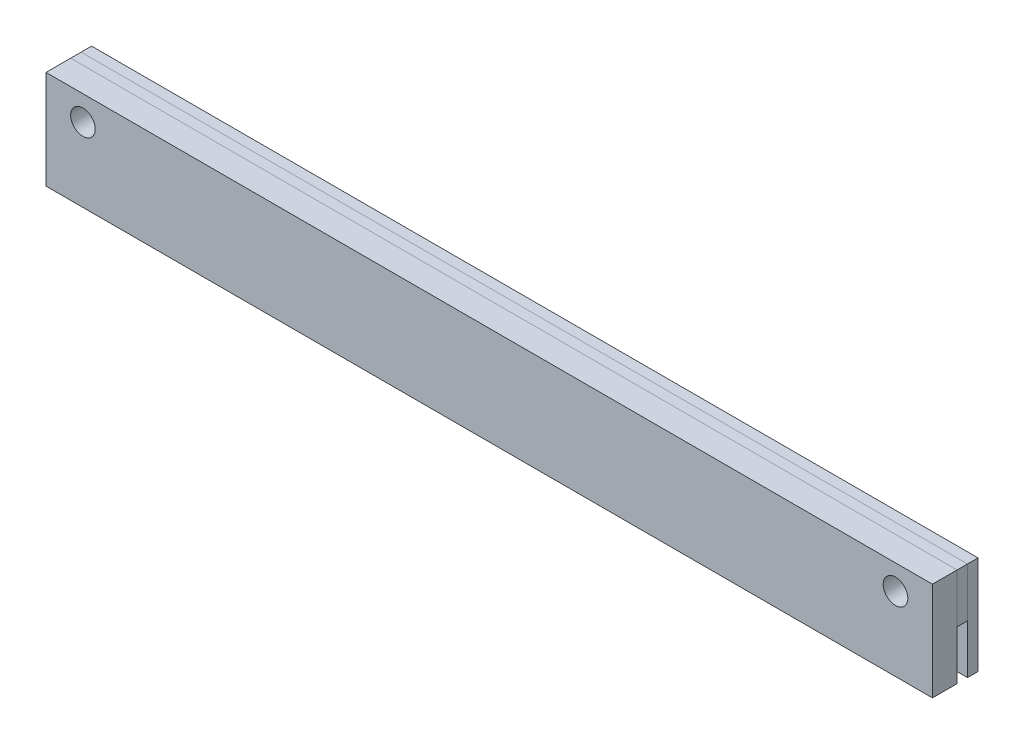
ISO-10303-21;
HEADER;
FILE_DESCRIPTION(('STEP AP214'),'2;1');
FILE_NAME('part.step','',(''),(''),'','','');
FILE_SCHEMA(('AUTOMOTIVE_DESIGN { 1 0 10303 214 1 1 1 1 }'));
ENDSEC;
DATA;
#1=APPLICATION_CONTEXT('core data for automotive mechanical design processes');
#2=APPLICATION_PROTOCOL_DEFINITION('international standard','automotive_design',2000,#1);
#3=PRODUCT_CONTEXT('',#1,'mechanical');
#4=PRODUCT('Part','Part','',(#3));
#5=PRODUCT_RELATED_PRODUCT_CATEGORY('part','',(#4));
#6=PRODUCT_DEFINITION_FORMATION('','',#4);
#7=PRODUCT_DEFINITION_CONTEXT('part definition',#1,'design');
#8=PRODUCT_DEFINITION('design','',#6,#7);
#9=PRODUCT_DEFINITION_SHAPE('','',#8);
#10=(LENGTH_UNIT() NAMED_UNIT(*) SI_UNIT(.MILLI.,.METRE.));
#11=(NAMED_UNIT(*) PLANE_ANGLE_UNIT() SI_UNIT($,.RADIAN.));
#12=(NAMED_UNIT(*) SI_UNIT($,.STERADIAN.) SOLID_ANGLE_UNIT());
#13=UNCERTAINTY_MEASURE_WITH_UNIT(LENGTH_MEASURE(1.E-05),#10,'distance_accuracy_value','');
#14=(GEOMETRIC_REPRESENTATION_CONTEXT(3) GLOBAL_UNCERTAINTY_ASSIGNED_CONTEXT((#13)) GLOBAL_UNIT_ASSIGNED_CONTEXT((#10,
#11,#12)) REPRESENTATION_CONTEXT('',''));
#15=CARTESIAN_POINT('',(0.,0.,0.));
#16=DIRECTION('',(0.,0.,1.));
#17=DIRECTION('',(1.,0.,0.));
#18=AXIS2_PLACEMENT_3D('',#15,#16,#17);
#19=CARTESIAN_POINT('',(114.3,0.,-4.05));
#20=DIRECTION('',(0.,0.,-1.));
#21=DIRECTION('',(0.,1.,0.));
#22=AXIS2_PLACEMENT_3D('',#19,#20,#21);
#23=PLANE('',#22);
#24=CARTESIAN_POINT('',(-104.775,0.,-4.05));
#25=DIRECTION('',(0.,0.,-1.));
#26=DIRECTION('',(0.,1.,0.));
#27=AXIS2_PLACEMENT_3D('',#24,#25,#26);
#28=CIRCLE('',#27,3.175);
#29=CARTESIAN_POINT('',(-104.775,3.17500000000002,-4.05));
#30=VERTEX_POINT('',#29);
#31=EDGE_CURVE('E124',#30,#30,#28,.F.);
#32=ORIENTED_EDGE('',*,*,#31,.T.);
#33=EDGE_LOOP('',(#32));
#34=FACE_BOUND('',#33,.T.);
#35=CARTESIAN_POINT('',(104.775,0.,-4.05));
#36=DIRECTION('',(0.,0.,-1.));
#37=DIRECTION('',(0.,1.,0.));
#38=AXIS2_PLACEMENT_3D('',#35,#36,#37);
#39=CIRCLE('',#38,3.175);
#40=CARTESIAN_POINT('',(104.775,3.17500000000002,-4.05));
#41=VERTEX_POINT('',#40);
#42=EDGE_CURVE('E129',#41,#41,#39,.F.);
#43=ORIENTED_EDGE('',*,*,#42,.T.);
#44=EDGE_LOOP('',(#43));
#45=FACE_BOUND('',#44,.T.);
#46=DIRECTION('',(0.,-1.,0.));
#47=VECTOR('',#46,1.);
#48=CARTESIAN_POINT('',(-114.3,0.,-4.05));
#49=LINE('',#48,#47);
#50=CARTESIAN_POINT('',(-114.3,6.35,-4.05));
#51=VERTEX_POINT('',#50);
#52=CARTESIAN_POINT('',(-114.3,-19.05,-4.05));
#53=VERTEX_POINT('',#52);
#54=EDGE_CURVE('E115',#51,#53,#49,.T.);
#55=ORIENTED_EDGE('',*,*,#54,.F.);
#56=DIRECTION('',(-1.,0.,0.));
#57=VECTOR('',#56,1.);
#58=CARTESIAN_POINT('',(114.3,6.35,-4.05));
#59=LINE('',#58,#57);
#60=CARTESIAN_POINT('',(114.3,6.35,-4.05));
#61=VERTEX_POINT('',#60);
#62=EDGE_CURVE('E12',#61,#51,#59,.T.);
#63=ORIENTED_EDGE('',*,*,#62,.F.);
#64=DIRECTION('',(0.,-1.,0.));
#65=VECTOR('',#64,1.);
#66=CARTESIAN_POINT('',(114.3,0.,-4.05));
#67=LINE('',#66,#65);
#68=CARTESIAN_POINT('',(114.3,-19.05,-4.05));
#69=VERTEX_POINT('',#68);
#70=EDGE_CURVE('E108',#61,#69,#67,.T.);
#71=ORIENTED_EDGE('',*,*,#70,.T.);
#72=DIRECTION('',(-1.,0.,0.));
#73=VECTOR('',#72,1.);
#74=CARTESIAN_POINT('',(114.3,-19.05,-4.05));
#75=LINE('',#74,#73);
#76=EDGE_CURVE('E88',#69,#53,#75,.T.);
#77=ORIENTED_EDGE('',*,*,#76,.T.);
#78=EDGE_LOOP('',(#55,#63,#71,#77));
#79=FACE_BOUND('',#78,.T.);
#80=ADVANCED_FACE('F48',(#34,#45,#79),#23,.T.);
#81=CARTESIAN_POINT('',(114.3,6.35,0.));
#82=DIRECTION('',(0.,1.,0.));
#83=DIRECTION('',(0.,0.,1.));
#84=AXIS2_PLACEMENT_3D('',#81,#82,#83);
#85=PLANE('',#84);
#86=DIRECTION('',(0.,0.,-1.));
#87=VECTOR('',#86,1.);
#88=CARTESIAN_POINT('',(-114.3,6.35,0.));
#89=LINE('',#88,#87);
#90=CARTESIAN_POINT('',(-114.3,6.35,-1.35));
#91=VERTEX_POINT('',#90);
#92=EDGE_CURVE('E101',#91,#51,#89,.T.);
#93=ORIENTED_EDGE('',*,*,#92,.F.);
#94=DIRECTION('',(-1.,0.,0.));
#95=VECTOR('',#94,1.);
#96=CARTESIAN_POINT('',(114.3,6.35,-1.35));
#97=LINE('',#96,#95);
#98=CARTESIAN_POINT('',(114.3,6.35,-1.35));
#99=VERTEX_POINT('',#98);
#100=EDGE_CURVE('E57',#99,#91,#97,.T.);
#101=ORIENTED_EDGE('',*,*,#100,.F.);
#102=DIRECTION('',(0.,0.,-1.));
#103=VECTOR('',#102,1.);
#104=CARTESIAN_POINT('',(114.3,6.35,0.));
#105=LINE('',#104,#103);
#106=EDGE_CURVE('E99',#99,#61,#105,.T.);
#107=ORIENTED_EDGE('',*,*,#106,.T.);
#108=ORIENTED_EDGE('',*,*,#62,.T.);
#109=EDGE_LOOP('',(#93,#101,#107,#108));
#110=FACE_BOUND('',#109,.T.);
#111=ADVANCED_FACE('F97',(#110),#85,.T.);
#112=CARTESIAN_POINT('',(114.3,0.,-1.35));
#113=DIRECTION('',(0.,0.,-1.));
#114=DIRECTION('',(0.,1.,0.));
#115=AXIS2_PLACEMENT_3D('',#112,#113,#114);
#116=PLANE('',#115);
#117=CARTESIAN_POINT('',(-104.775,0.,-1.35));
#118=DIRECTION('',(0.,0.,-1.));
#119=DIRECTION('',(0.,1.,0.));
#120=AXIS2_PLACEMENT_3D('',#117,#118,#119);
#121=CIRCLE('',#120,3.175);
#122=CARTESIAN_POINT('',(-104.775,3.17500000000002,-1.35));
#123=VERTEX_POINT('',#122);
#124=EDGE_CURVE('E51',#123,#123,#121,.T.);
#125=ORIENTED_EDGE('',*,*,#124,.T.);
#126=EDGE_LOOP('',(#125));
#127=FACE_BOUND('',#126,.T.);
#128=CARTESIAN_POINT('',(104.775,0.,-1.35));
#129=DIRECTION('',(0.,0.,-1.));
#130=DIRECTION('',(0.,1.,0.));
#131=AXIS2_PLACEMENT_3D('',#128,#129,#130);
#132=CIRCLE('',#131,3.175);
#133=CARTESIAN_POINT('',(104.775,3.17500000000002,-1.35));
#134=VERTEX_POINT('',#133);
#135=EDGE_CURVE('E122',#134,#134,#132,.T.);
#136=ORIENTED_EDGE('',*,*,#135,.T.);
#137=EDGE_LOOP('',(#136));
#138=FACE_BOUND('',#137,.T.);
#139=DIRECTION('',(0.,-1.,0.));
#140=VECTOR('',#139,1.);
#141=CARTESIAN_POINT('',(-114.3,0.,-1.35));
#142=LINE('',#141,#140);
#143=CARTESIAN_POINT('',(-114.3,-19.05,-1.35));
#144=VERTEX_POINT('',#143);
#145=EDGE_CURVE('E81',#91,#144,#142,.T.);
#146=ORIENTED_EDGE('',*,*,#145,.T.);
#147=DIRECTION('',(-1.,0.,0.));
#148=VECTOR('',#147,1.);
#149=CARTESIAN_POINT('',(114.3,-19.05,-1.35));
#150=LINE('',#149,#148);
#151=CARTESIAN_POINT('',(114.3,-19.05,-1.35));
#152=VERTEX_POINT('',#151);
#153=EDGE_CURVE('E102',#152,#144,#150,.T.);
#154=ORIENTED_EDGE('',*,*,#153,.F.);
#155=DIRECTION('',(0.,-1.,0.));
#156=VECTOR('',#155,1.);
#157=CARTESIAN_POINT('',(114.3,0.,-1.35));
#158=LINE('',#157,#156);
#159=EDGE_CURVE('E104',#99,#152,#158,.T.);
#160=ORIENTED_EDGE('',*,*,#159,.F.);
#161=ORIENTED_EDGE('',*,*,#100,.T.);
#162=EDGE_LOOP('',(#146,#154,#160,#161));
#163=FACE_BOUND('',#162,.T.);
#164=ADVANCED_FACE('F105',(#127,#138,#163),#116,.F.);
#165=CARTESIAN_POINT('',(114.3,-19.05,0.));
#166=DIRECTION('',(0.,1.,0.));
#167=DIRECTION('',(0.,0.,1.));
#168=AXIS2_PLACEMENT_3D('',#165,#166,#167);
#169=PLANE('',#168);
#170=DIRECTION('',(0.,0.,-1.));
#171=VECTOR('',#170,1.);
#172=CARTESIAN_POINT('',(-114.3,-19.05,0.));
#173=LINE('',#172,#171);
#174=EDGE_CURVE('E110',#144,#53,#173,.T.);
#175=ORIENTED_EDGE('',*,*,#174,.T.);
#176=ORIENTED_EDGE('',*,*,#76,.F.);
#177=DIRECTION('',(0.,0.,-1.));
#178=VECTOR('',#177,1.);
#179=CARTESIAN_POINT('',(114.3,-19.05,0.));
#180=LINE('',#179,#178);
#181=EDGE_CURVE('E66',#152,#69,#180,.T.);
#182=ORIENTED_EDGE('',*,*,#181,.F.);
#183=ORIENTED_EDGE('',*,*,#153,.T.);
#184=EDGE_LOOP('',(#175,#176,#182,#183));
#185=FACE_BOUND('',#184,.T.);
#186=ADVANCED_FACE('F159',(#185),#169,.F.);
#187=CARTESIAN_POINT('',(114.3,0.,0.));
#188=DIRECTION('',(1.,0.,0.));
#189=DIRECTION('',(0.,0.,-1.));
#190=AXIS2_PLACEMENT_3D('',#187,#188,#189);
#191=PLANE('',#190);
#192=ORIENTED_EDGE('',*,*,#70,.F.);
#193=ORIENTED_EDGE('',*,*,#106,.F.);
#194=ORIENTED_EDGE('',*,*,#159,.T.);
#195=ORIENTED_EDGE('',*,*,#181,.T.);
#196=EDGE_LOOP('',(#192,#193,#194,#195));
#197=FACE_BOUND('',#196,.T.);
#198=ADVANCED_FACE('F107',(#197),#191,.T.);
#199=CARTESIAN_POINT('',(-114.3,0.,0.));
#200=DIRECTION('',(1.,0.,0.));
#201=DIRECTION('',(0.,0.,-1.));
#202=AXIS2_PLACEMENT_3D('',#199,#200,#201);
#203=PLANE('',#202);
#204=ORIENTED_EDGE('',*,*,#54,.T.);
#205=ORIENTED_EDGE('',*,*,#174,.F.);
#206=ORIENTED_EDGE('',*,*,#145,.F.);
#207=ORIENTED_EDGE('',*,*,#92,.T.);
#208=EDGE_LOOP('',(#204,#205,#206,#207));
#209=FACE_BOUND('',#208,.T.);
#210=ADVANCED_FACE('F141',(#209),#203,.F.);
#211=CARTESIAN_POINT('',(104.775,0.,-13.0302561210691));
#212=DIRECTION('',(0.,0.,1.));
#213=DIRECTION('',(1.,0.,0.));
#214=AXIS2_PLACEMENT_3D('',#211,#212,#213);
#215=CYLINDRICAL_SURFACE('',#214,3.175);
#216=ORIENTED_EDGE('',*,*,#42,.F.);
#217=EDGE_LOOP('',(#216));
#218=FACE_BOUND('',#217,.T.);
#219=ORIENTED_EDGE('',*,*,#135,.F.);
#220=EDGE_LOOP('',(#219));
#221=FACE_BOUND('',#220,.T.);
#222=ADVANCED_FACE('F137',(#218,#221),#215,.F.);
#223=CARTESIAN_POINT('',(-104.775,0.,-13.0302561210691));
#224=DIRECTION('',(0.,0.,1.));
#225=DIRECTION('',(1.,0.,0.));
#226=AXIS2_PLACEMENT_3D('',#223,#224,#225);
#227=CYLINDRICAL_SURFACE('',#226,3.175);
#228=ORIENTED_EDGE('',*,*,#31,.F.);
#229=EDGE_LOOP('',(#228));
#230=FACE_BOUND('',#229,.T.);
#231=ORIENTED_EDGE('',*,*,#124,.F.);
#232=EDGE_LOOP('',(#231));
#233=FACE_BOUND('',#232,.T.);
#234=ADVANCED_FACE('F140',(#230,#233),#227,.F.);
#235=CLOSED_SHELL('',(#80,#111,#164,#186,#198,#210,#222,#234));
#236=MANIFOLD_SOLID_BREP('B2',#235);
#237=CARTESIAN_POINT('',(114.3,0.,-1.35));
#238=DIRECTION('',(0.,0.,-1.));
#239=DIRECTION('',(0.,1.,0.));
#240=AXIS2_PLACEMENT_3D('',#237,#238,#239);
#241=PLANE('',#240);
#242=CARTESIAN_POINT('',(-104.775,0.,-1.35));
#243=DIRECTION('',(0.,0.,-1.));
#244=DIRECTION('',(0.,1.,0.));
#245=AXIS2_PLACEMENT_3D('',#242,#243,#244);
#246=CIRCLE('',#245,3.175);
#247=CARTESIAN_POINT('',(-104.775,3.17500000000002,-1.35));
#248=VERTEX_POINT('',#247);
#249=EDGE_CURVE('E296',#248,#248,#246,.T.);
#250=ORIENTED_EDGE('',*,*,#249,.F.);
#251=EDGE_LOOP('',(#250));
#252=FACE_BOUND('',#251,.T.);
#253=CARTESIAN_POINT('',(104.775,0.,-1.35));
#254=DIRECTION('',(0.,0.,-1.));
#255=DIRECTION('',(0.,1.,0.));
#256=AXIS2_PLACEMENT_3D('',#253,#254,#255);
#257=CIRCLE('',#256,3.175);
#258=CARTESIAN_POINT('',(104.775,3.17500000000002,-1.35));
#259=VERTEX_POINT('',#258);
#260=EDGE_CURVE('E303',#259,#259,#257,.T.);
#261=ORIENTED_EDGE('',*,*,#260,.F.);
#262=EDGE_LOOP('',(#261));
#263=FACE_BOUND('',#262,.T.);
#264=DIRECTION('',(0.,-1.,0.));
#265=VECTOR('',#264,1.);
#266=CARTESIAN_POINT('',(-114.3,0.,-1.35));
#267=LINE('',#266,#265);
#268=CARTESIAN_POINT('',(-114.3,6.35,-1.35));
#269=VERTEX_POINT('',#268);
#270=CARTESIAN_POINT('',(-114.3,-6.35,-1.35));
#271=VERTEX_POINT('',#270);
#272=EDGE_CURVE('E293',#269,#271,#267,.T.);
#273=ORIENTED_EDGE('',*,*,#272,.F.);
#274=DIRECTION('',(-1.,0.,0.));
#275=VECTOR('',#274,1.);
#276=CARTESIAN_POINT('',(114.3,6.35,-1.35));
#277=LINE('',#276,#275);
#278=CARTESIAN_POINT('',(114.3,6.35,-1.35));
#279=VERTEX_POINT('',#278);
#280=EDGE_CURVE('E46',#279,#269,#277,.T.);
#281=ORIENTED_EDGE('',*,*,#280,.F.);
#282=DIRECTION('',(0.,-1.,0.));
#283=VECTOR('',#282,1.);
#284=CARTESIAN_POINT('',(114.3,0.,-1.35));
#285=LINE('',#284,#283);
#286=CARTESIAN_POINT('',(114.3,-6.35,-1.35));
#287=VERTEX_POINT('',#286);
#288=EDGE_CURVE('E286',#279,#287,#285,.T.);
#289=ORIENTED_EDGE('',*,*,#288,.T.);
#290=DIRECTION('',(-1.,0.,0.));
#291=VECTOR('',#290,1.);
#292=CARTESIAN_POINT('',(114.3,-6.35,-1.35));
#293=LINE('',#292,#291);
#294=EDGE_CURVE('E266',#287,#271,#293,.T.);
#295=ORIENTED_EDGE('',*,*,#294,.T.);
#296=EDGE_LOOP('',(#273,#281,#289,#295));
#297=FACE_BOUND('',#296,.T.);
#298=ADVANCED_FACE('F226',(#252,#263,#297),#241,.T.);
#299=CARTESIAN_POINT('',(114.3,6.35,0.));
#300=DIRECTION('',(0.,1.,0.));
#301=DIRECTION('',(0.,0.,1.));
#302=AXIS2_PLACEMENT_3D('',#299,#300,#301);
#303=PLANE('',#302);
#304=DIRECTION('',(0.,0.,-1.));
#305=VECTOR('',#304,1.);
#306=CARTESIAN_POINT('',(-114.3,6.35,0.));
#307=LINE('',#306,#305);
#308=CARTESIAN_POINT('',(-114.3,6.35,1.35));
#309=VERTEX_POINT('',#308);
#310=EDGE_CURVE('E279',#309,#269,#307,.T.);
#311=ORIENTED_EDGE('',*,*,#310,.F.);
#312=DIRECTION('',(-1.,0.,0.));
#313=VECTOR('',#312,1.);
#314=CARTESIAN_POINT('',(114.3,6.35,1.35));
#315=LINE('',#314,#313);
#316=CARTESIAN_POINT('',(114.3,6.35,1.35));
#317=VERTEX_POINT('',#316);
#318=EDGE_CURVE('E235',#317,#309,#315,.T.);
#319=ORIENTED_EDGE('',*,*,#318,.F.);
#320=DIRECTION('',(0.,0.,-1.));
#321=VECTOR('',#320,1.);
#322=CARTESIAN_POINT('',(114.3,6.35,0.));
#323=LINE('',#322,#321);
#324=EDGE_CURVE('E277',#317,#279,#323,.T.);
#325=ORIENTED_EDGE('',*,*,#324,.T.);
#326=ORIENTED_EDGE('',*,*,#280,.T.);
#327=EDGE_LOOP('',(#311,#319,#325,#326));
#328=FACE_BOUND('',#327,.T.);
#329=ADVANCED_FACE('F275',(#328),#303,.T.);
#330=CARTESIAN_POINT('',(114.3,0.,1.35));
#331=DIRECTION('',(0.,0.,-1.));
#332=DIRECTION('',(0.,1.,0.));
#333=AXIS2_PLACEMENT_3D('',#330,#331,#332);
#334=PLANE('',#333);
#335=CARTESIAN_POINT('',(-104.775,0.,1.35));
#336=DIRECTION('',(0.,0.,-1.));
#337=DIRECTION('',(0.,1.,0.));
#338=AXIS2_PLACEMENT_3D('',#335,#336,#337);
#339=CIRCLE('',#338,3.175);
#340=CARTESIAN_POINT('',(-104.775,3.17500000000002,1.35));
#341=VERTEX_POINT('',#340);
#342=EDGE_CURVE('E229',#341,#341,#339,.T.);
#343=ORIENTED_EDGE('',*,*,#342,.T.);
#344=EDGE_LOOP('',(#343));
#345=FACE_BOUND('',#344,.T.);
#346=CARTESIAN_POINT('',(104.775,0.,1.35));
#347=DIRECTION('',(0.,0.,-1.));
#348=DIRECTION('',(0.,1.,0.));
#349=AXIS2_PLACEMENT_3D('',#346,#347,#348);
#350=CIRCLE('',#349,3.175);
#351=CARTESIAN_POINT('',(104.775,3.17500000000002,1.35));
#352=VERTEX_POINT('',#351);
#353=EDGE_CURVE('E301',#352,#352,#350,.T.);
#354=ORIENTED_EDGE('',*,*,#353,.T.);
#355=EDGE_LOOP('',(#354));
#356=FACE_BOUND('',#355,.T.);
#357=DIRECTION('',(0.,-1.,0.));
#358=VECTOR('',#357,1.);
#359=CARTESIAN_POINT('',(-114.3,0.,1.35));
#360=LINE('',#359,#358);
#361=CARTESIAN_POINT('',(-114.3,-6.35,1.35));
#362=VERTEX_POINT('',#361);
#363=EDGE_CURVE('E259',#309,#362,#360,.T.);
#364=ORIENTED_EDGE('',*,*,#363,.T.);
#365=DIRECTION('',(-1.,0.,0.));
#366=VECTOR('',#365,1.);
#367=CARTESIAN_POINT('',(114.3,-6.35,1.35));
#368=LINE('',#367,#366);
#369=CARTESIAN_POINT('',(114.3,-6.35,1.35));
#370=VERTEX_POINT('',#369);
#371=EDGE_CURVE('E280',#370,#362,#368,.T.);
#372=ORIENTED_EDGE('',*,*,#371,.F.);
#373=DIRECTION('',(0.,-1.,0.));
#374=VECTOR('',#373,1.);
#375=CARTESIAN_POINT('',(114.3,0.,1.35));
#376=LINE('',#375,#374);
#377=EDGE_CURVE('E282',#317,#370,#376,.T.);
#378=ORIENTED_EDGE('',*,*,#377,.F.);
#379=ORIENTED_EDGE('',*,*,#318,.T.);
#380=EDGE_LOOP('',(#364,#372,#378,#379));
#381=FACE_BOUND('',#380,.T.);
#382=ADVANCED_FACE('F283',(#345,#356,#381),#334,.F.);
#383=CARTESIAN_POINT('',(114.3,-6.35,0.));
#384=DIRECTION('',(0.,1.,0.));
#385=DIRECTION('',(0.,0.,1.));
#386=AXIS2_PLACEMENT_3D('',#383,#384,#385);
#387=PLANE('',#386);
#388=DIRECTION('',(0.,0.,-1.));
#389=VECTOR('',#388,1.);
#390=CARTESIAN_POINT('',(-114.3,-6.35,0.));
#391=LINE('',#390,#389);
#392=EDGE_CURVE('E288',#362,#271,#391,.T.);
#393=ORIENTED_EDGE('',*,*,#392,.T.);
#394=ORIENTED_EDGE('',*,*,#294,.F.);
#395=DIRECTION('',(0.,0.,-1.));
#396=VECTOR('',#395,1.);
#397=CARTESIAN_POINT('',(114.3,-6.35,0.));
#398=LINE('',#397,#396);
#399=EDGE_CURVE('E244',#370,#287,#398,.T.);
#400=ORIENTED_EDGE('',*,*,#399,.F.);
#401=ORIENTED_EDGE('',*,*,#371,.T.);
#402=EDGE_LOOP('',(#393,#394,#400,#401));
#403=FACE_BOUND('',#402,.T.);
#404=ADVANCED_FACE('F323',(#403),#387,.F.);
#405=CARTESIAN_POINT('',(114.3,0.,0.));
#406=DIRECTION('',(1.,0.,0.));
#407=DIRECTION('',(0.,0.,-1.));
#408=AXIS2_PLACEMENT_3D('',#405,#406,#407);
#409=PLANE('',#408);
#410=ORIENTED_EDGE('',*,*,#288,.F.);
#411=ORIENTED_EDGE('',*,*,#324,.F.);
#412=ORIENTED_EDGE('',*,*,#377,.T.);
#413=ORIENTED_EDGE('',*,*,#399,.T.);
#414=EDGE_LOOP('',(#410,#411,#412,#413));
#415=FACE_BOUND('',#414,.T.);
#416=ADVANCED_FACE('F285',(#415),#409,.T.);
#417=CARTESIAN_POINT('',(-114.3,0.,0.));
#418=DIRECTION('',(1.,0.,0.));
#419=DIRECTION('',(0.,0.,-1.));
#420=AXIS2_PLACEMENT_3D('',#417,#418,#419);
#421=PLANE('',#420);
#422=ORIENTED_EDGE('',*,*,#272,.T.);
#423=ORIENTED_EDGE('',*,*,#392,.F.);
#424=ORIENTED_EDGE('',*,*,#363,.F.);
#425=ORIENTED_EDGE('',*,*,#310,.T.);
#426=EDGE_LOOP('',(#422,#423,#424,#425));
#427=FACE_BOUND('',#426,.T.);
#428=ADVANCED_FACE('F321',(#427),#421,.F.);
#429=CARTESIAN_POINT('',(104.775,0.,-13.0302561210691));
#430=DIRECTION('',(0.,0.,1.));
#431=DIRECTION('',(1.,0.,0.));
#432=AXIS2_PLACEMENT_3D('',#429,#430,#431);
#433=CYLINDRICAL_SURFACE('',#432,3.175);
#434=ORIENTED_EDGE('',*,*,#260,.T.);
#435=EDGE_LOOP('',(#434));
#436=FACE_BOUND('',#435,.T.);
#437=ORIENTED_EDGE('',*,*,#353,.F.);
#438=EDGE_LOOP('',(#437));
#439=FACE_BOUND('',#438,.T.);
#440=ADVANCED_FACE('F353',(#436,#439),#433,.F.);
#441=CARTESIAN_POINT('',(-104.775,0.,-13.0302561210691));
#442=DIRECTION('',(0.,0.,1.));
#443=DIRECTION('',(1.,0.,0.));
#444=AXIS2_PLACEMENT_3D('',#441,#442,#443);
#445=CYLINDRICAL_SURFACE('',#444,3.175);
#446=ORIENTED_EDGE('',*,*,#249,.T.);
#447=EDGE_LOOP('',(#446));
#448=FACE_BOUND('',#447,.T.);
#449=ORIENTED_EDGE('',*,*,#342,.F.);
#450=EDGE_LOOP('',(#449));
#451=FACE_BOUND('',#450,.T.);
#452=ADVANCED_FACE('F314',(#448,#451),#445,.F.);
#453=CLOSED_SHELL('',(#298,#329,#382,#404,#416,#428,#440,#452));
#454=MANIFOLD_SOLID_BREP('B6',#453);
#455=CARTESIAN_POINT('',(114.3,0.,1.35));
#456=DIRECTION('',(0.,0.,-1.));
#457=DIRECTION('',(0.,1.,0.));
#458=AXIS2_PLACEMENT_3D('',#455,#456,#457);
#459=PLANE('',#458);
#460=CARTESIAN_POINT('',(-104.775,0.,1.35));
#461=DIRECTION('',(0.,0.,-1.));
#462=DIRECTION('',(0.,1.,0.));
#463=AXIS2_PLACEMENT_3D('',#460,#461,#462);
#464=CIRCLE('',#463,3.175);
#465=CARTESIAN_POINT('',(-104.775,3.17500000000002,1.35));
#466=VERTEX_POINT('',#465);
#467=EDGE_CURVE('E465',#466,#466,#464,.T.);
#468=ORIENTED_EDGE('',*,*,#467,.F.);
#469=EDGE_LOOP('',(#468));
#470=FACE_BOUND('',#469,.T.);
#471=CARTESIAN_POINT('',(104.775,0.,1.35));
#472=DIRECTION('',(0.,0.,-1.));
#473=DIRECTION('',(0.,1.,0.));
#474=AXIS2_PLACEMENT_3D('',#471,#472,#473);
#475=CIRCLE('',#474,3.175);
#476=CARTESIAN_POINT('',(104.775,3.17500000000002,1.35));
#477=VERTEX_POINT('',#476);
#478=EDGE_CURVE('E485',#477,#477,#475,.T.);
#479=ORIENTED_EDGE('',*,*,#478,.F.);
#480=EDGE_LOOP('',(#479));
#481=FACE_BOUND('',#480,.T.);
#482=DIRECTION('',(0.,-1.,0.));
#483=VECTOR('',#482,1.);
#484=CARTESIAN_POINT('',(-114.3,0.,1.35));
#485=LINE('',#484,#483);
#486=CARTESIAN_POINT('',(-114.3,6.35,1.35));
#487=VERTEX_POINT('',#486);
#488=CARTESIAN_POINT('',(-114.3,-19.05,1.35));
#489=VERTEX_POINT('',#488);
#490=EDGE_CURVE('E462',#487,#489,#485,.T.);
#491=ORIENTED_EDGE('',*,*,#490,.F.);
#492=DIRECTION('',(-1.,0.,0.));
#493=VECTOR('',#492,1.);
#494=CARTESIAN_POINT('',(114.3,6.35,1.35));
#495=LINE('',#494,#493);
#496=CARTESIAN_POINT('',(114.3,6.35,1.35));
#497=VERTEX_POINT('',#496);
#498=EDGE_CURVE('E224',#497,#487,#495,.T.);
#499=ORIENTED_EDGE('',*,*,#498,.F.);
#500=DIRECTION('',(0.,-1.,0.));
#501=VECTOR('',#500,1.);
#502=CARTESIAN_POINT('',(114.3,0.,1.35));
#503=LINE('',#502,#501);
#504=CARTESIAN_POINT('',(114.3,-19.05,1.35));
#505=VERTEX_POINT('',#504);
#506=EDGE_CURVE('E455',#497,#505,#503,.T.);
#507=ORIENTED_EDGE('',*,*,#506,.T.);
#508=DIRECTION('',(-1.,0.,0.));
#509=VECTOR('',#508,1.);
#510=CARTESIAN_POINT('',(114.3,-19.05,1.35));
#511=LINE('',#510,#509);
#512=EDGE_CURVE('E436',#505,#489,#511,.T.);
#513=ORIENTED_EDGE('',*,*,#512,.T.);
#514=EDGE_LOOP('',(#491,#499,#507,#513));
#515=FACE_BOUND('',#514,.T.);
#516=ADVANCED_FACE('F398',(#470,#481,#515),#459,.T.);
#517=CARTESIAN_POINT('',(114.3,6.35,0.));
#518=DIRECTION('',(0.,1.,0.));
#519=DIRECTION('',(0.,0.,1.));
#520=AXIS2_PLACEMENT_3D('',#517,#518,#519);
#521=PLANE('',#520);
#522=DIRECTION('',(0.,0.,-1.));
#523=VECTOR('',#522,1.);
#524=CARTESIAN_POINT('',(-114.3,6.35,0.));
#525=LINE('',#524,#523);
#526=CARTESIAN_POINT('',(-114.3,6.35,7.7));
#527=VERTEX_POINT('',#526);
#528=EDGE_CURVE('E449',#527,#487,#525,.T.);
#529=ORIENTED_EDGE('',*,*,#528,.F.);
#530=DIRECTION('',(-1.,0.,0.));
#531=VECTOR('',#530,1.);
#532=CARTESIAN_POINT('',(114.3,6.35,7.7));
#533=LINE('',#532,#531);
#534=CARTESIAN_POINT('',(114.3,6.35,7.7));
#535=VERTEX_POINT('',#534);
#536=EDGE_CURVE('E406',#535,#527,#533,.T.);
#537=ORIENTED_EDGE('',*,*,#536,.F.);
#538=DIRECTION('',(0.,0.,-1.));
#539=VECTOR('',#538,1.);
#540=CARTESIAN_POINT('',(114.3,6.35,0.));
#541=LINE('',#540,#539);
#542=EDGE_CURVE('E447',#535,#497,#541,.T.);
#543=ORIENTED_EDGE('',*,*,#542,.T.);
#544=ORIENTED_EDGE('',*,*,#498,.T.);
#545=EDGE_LOOP('',(#529,#537,#543,#544));
#546=FACE_BOUND('',#545,.T.);
#547=ADVANCED_FACE('F445',(#546),#521,.T.);
#548=CARTESIAN_POINT('',(114.3,0.,7.7));
#549=DIRECTION('',(0.,0.,-1.));
#550=DIRECTION('',(0.,1.,0.));
#551=AXIS2_PLACEMENT_3D('',#548,#549,#550);
#552=PLANE('',#551);
#553=CARTESIAN_POINT('',(-104.775,0.,7.7));
#554=DIRECTION('',(0.,0.,1.));
#555=DIRECTION('',(1.,0.,0.));
#556=AXIS2_PLACEMENT_3D('',#553,#554,#555);
#557=CIRCLE('',#556,3.175);
#558=CARTESIAN_POINT('',(-101.6,0.,7.7));
#559=VERTEX_POINT('',#558);
#560=EDGE_CURVE('E487',#559,#559,#557,.T.);
#561=ORIENTED_EDGE('',*,*,#560,.F.);
#562=EDGE_LOOP('',(#561));
#563=FACE_BOUND('',#562,.T.);
#564=CARTESIAN_POINT('',(104.775,0.,7.7));
#565=DIRECTION('',(0.,0.,1.));
#566=DIRECTION('',(1.,0.,0.));
#567=AXIS2_PLACEMENT_3D('',#564,#565,#566);
#568=CIRCLE('',#567,3.175);
#569=CARTESIAN_POINT('',(107.95,0.,7.7));
#570=VERTEX_POINT('',#569);
#571=EDGE_CURVE('E490',#570,#570,#568,.T.);
#572=ORIENTED_EDGE('',*,*,#571,.F.);
#573=EDGE_LOOP('',(#572));
#574=FACE_BOUND('',#573,.T.);
#575=DIRECTION('',(0.,-1.,0.));
#576=VECTOR('',#575,1.);
#577=CARTESIAN_POINT('',(-114.3,0.,7.7));
#578=LINE('',#577,#576);
#579=CARTESIAN_POINT('',(-114.3,-19.05,7.69999999999999));
#580=VERTEX_POINT('',#579);
#581=EDGE_CURVE('E429',#527,#580,#578,.T.);
#582=ORIENTED_EDGE('',*,*,#581,.T.);
#583=DIRECTION('',(-1.,0.,0.));
#584=VECTOR('',#583,1.);
#585=CARTESIAN_POINT('',(114.3,-19.05,7.69999999999999));
#586=LINE('',#585,#584);
#587=CARTESIAN_POINT('',(114.3,-19.05,7.69999999999999));
#588=VERTEX_POINT('',#587);
#589=EDGE_CURVE('E450',#588,#580,#586,.T.);
#590=ORIENTED_EDGE('',*,*,#589,.F.);
#591=DIRECTION('',(0.,-1.,0.));
#592=VECTOR('',#591,1.);
#593=CARTESIAN_POINT('',(114.3,0.,7.7));
#594=LINE('',#593,#592);
#595=EDGE_CURVE('E451',#535,#588,#594,.T.);
#596=ORIENTED_EDGE('',*,*,#595,.F.);
#597=ORIENTED_EDGE('',*,*,#536,.T.);
#598=EDGE_LOOP('',(#582,#590,#596,#597));
#599=FACE_BOUND('',#598,.T.);
#600=ADVANCED_FACE('F452',(#563,#574,#599),#552,.F.);
#601=CARTESIAN_POINT('',(114.3,-19.05,0.));
#602=DIRECTION('',(0.,1.,0.));
#603=DIRECTION('',(0.,0.,1.));
#604=AXIS2_PLACEMENT_3D('',#601,#602,#603);
#605=PLANE('',#604);
#606=DIRECTION('',(0.,0.,-1.));
#607=VECTOR('',#606,1.);
#608=CARTESIAN_POINT('',(-114.3,-19.05,0.));
#609=LINE('',#608,#607);
#610=EDGE_CURVE('E457',#580,#489,#609,.T.);
#611=ORIENTED_EDGE('',*,*,#610,.T.);
#612=ORIENTED_EDGE('',*,*,#512,.F.);
#613=DIRECTION('',(0.,0.,-1.));
#614=VECTOR('',#613,1.);
#615=CARTESIAN_POINT('',(114.3,-19.05,0.));
#616=LINE('',#615,#614);
#617=EDGE_CURVE('E414',#588,#505,#616,.T.);
#618=ORIENTED_EDGE('',*,*,#617,.F.);
#619=ORIENTED_EDGE('',*,*,#589,.T.);
#620=EDGE_LOOP('',(#611,#612,#618,#619));
#621=FACE_BOUND('',#620,.T.);
#622=ADVANCED_FACE('F472',(#621),#605,.F.);
#623=CARTESIAN_POINT('',(114.3,0.,0.));
#624=DIRECTION('',(1.,0.,0.));
#625=DIRECTION('',(0.,0.,-1.));
#626=AXIS2_PLACEMENT_3D('',#623,#624,#625);
#627=PLANE('',#626);
#628=ORIENTED_EDGE('',*,*,#506,.F.);
#629=ORIENTED_EDGE('',*,*,#542,.F.);
#630=ORIENTED_EDGE('',*,*,#595,.T.);
#631=ORIENTED_EDGE('',*,*,#617,.T.);
#632=EDGE_LOOP('',(#628,#629,#630,#631));
#633=FACE_BOUND('',#632,.T.);
#634=ADVANCED_FACE('F454',(#633),#627,.T.);
#635=CARTESIAN_POINT('',(-114.3,0.,0.));
#636=DIRECTION('',(1.,0.,0.));
#637=DIRECTION('',(0.,0.,-1.));
#638=AXIS2_PLACEMENT_3D('',#635,#636,#637);
#639=PLANE('',#638);
#640=ORIENTED_EDGE('',*,*,#490,.T.);
#641=ORIENTED_EDGE('',*,*,#610,.F.);
#642=ORIENTED_EDGE('',*,*,#581,.F.);
#643=ORIENTED_EDGE('',*,*,#528,.T.);
#644=EDGE_LOOP('',(#640,#641,#642,#643));
#645=FACE_BOUND('',#644,.T.);
#646=ADVANCED_FACE('F474',(#645),#639,.F.);
#647=CARTESIAN_POINT('',(104.775,0.,-13.0302561210691));
#648=DIRECTION('',(0.,0.,1.));
#649=DIRECTION('',(1.,0.,0.));
#650=AXIS2_PLACEMENT_3D('',#647,#648,#649);
#651=CYLINDRICAL_SURFACE('',#650,3.175);
#652=ORIENTED_EDGE('',*,*,#478,.T.);
#653=EDGE_LOOP('',(#652));
#654=FACE_BOUND('',#653,.T.);
#655=ORIENTED_EDGE('',*,*,#571,.T.);
#656=EDGE_LOOP('',(#655));
#657=FACE_BOUND('',#656,.T.);
#658=ADVANCED_FACE('F496',(#654,#657),#651,.F.);
#659=CARTESIAN_POINT('',(-104.775,0.,-13.0302561210691));
#660=DIRECTION('',(0.,0.,1.));
#661=DIRECTION('',(1.,0.,0.));
#662=AXIS2_PLACEMENT_3D('',#659,#660,#661);
#663=CYLINDRICAL_SURFACE('',#662,3.175);
#664=ORIENTED_EDGE('',*,*,#467,.T.);
#665=EDGE_LOOP('',(#664));
#666=FACE_BOUND('',#665,.T.);
#667=ORIENTED_EDGE('',*,*,#560,.T.);
#668=EDGE_LOOP('',(#667));
#669=FACE_BOUND('',#668,.T.);
#670=ADVANCED_FACE('F513',(#666,#669),#663,.F.);
#671=CLOSED_SHELL('',(#516,#547,#600,#622,#634,#646,#658,#670));
#672=MANIFOLD_SOLID_BREP('B40',#671);
#673=ADVANCED_BREP_SHAPE_REPRESENTATION('',(#18,#236,#454,#672),#14);
#674=SHAPE_DEFINITION_REPRESENTATION(#9,#673);
ENDSEC;
END-ISO-10303-21;
